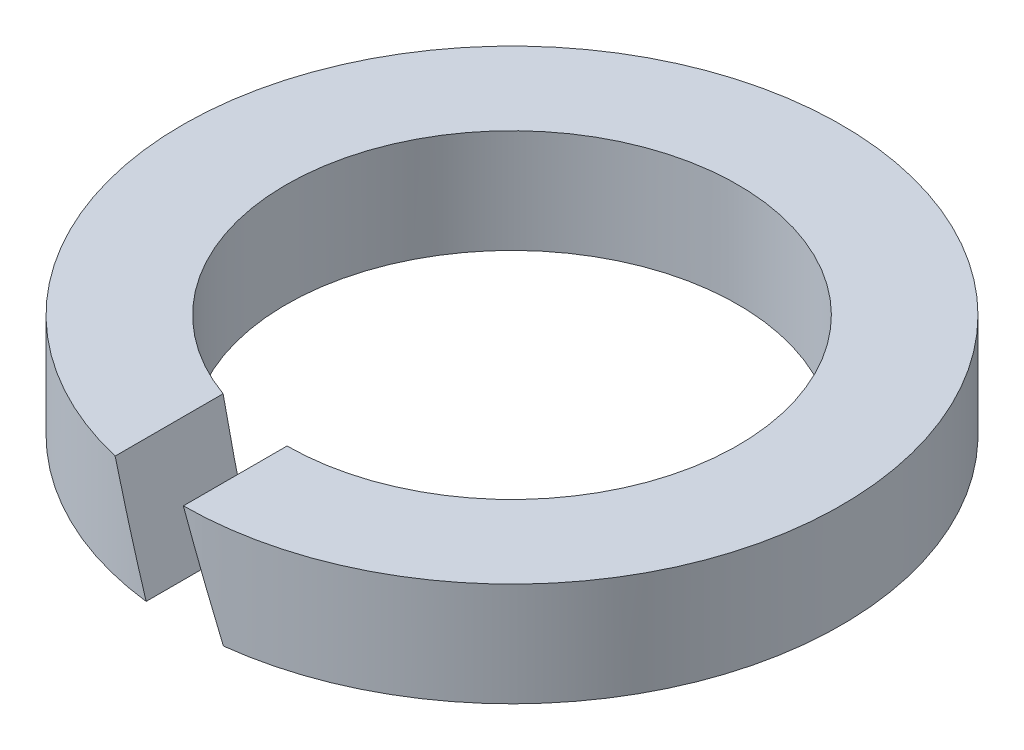
ISO-10303-21;
HEADER;
FILE_DESCRIPTION(('STEP AP214'),'2;1');
FILE_NAME('part.step','',(''),(''),'','','');
FILE_SCHEMA(('AUTOMOTIVE_DESIGN { 1 0 10303 214 1 1 1 1 }'));
ENDSEC;
DATA;
#1=APPLICATION_CONTEXT('core data for automotive mechanical design processes');
#2=APPLICATION_PROTOCOL_DEFINITION('international standard','automotive_design',2000,#1);
#3=PRODUCT_CONTEXT('',#1,'mechanical');
#4=PRODUCT('Part','Part','',(#3));
#5=PRODUCT_RELATED_PRODUCT_CATEGORY('part','',(#4));
#6=PRODUCT_DEFINITION_FORMATION('','',#4);
#7=PRODUCT_DEFINITION_CONTEXT('part definition',#1,'design');
#8=PRODUCT_DEFINITION('design','',#6,#7);
#9=PRODUCT_DEFINITION_SHAPE('','',#8);
#10=(LENGTH_UNIT() NAMED_UNIT(*) SI_UNIT(.MILLI.,.METRE.));
#11=(NAMED_UNIT(*) PLANE_ANGLE_UNIT() SI_UNIT($,.RADIAN.));
#12=(NAMED_UNIT(*) SI_UNIT($,.STERADIAN.) SOLID_ANGLE_UNIT());
#13=UNCERTAINTY_MEASURE_WITH_UNIT(LENGTH_MEASURE(1.E-05),#10,'distance_accuracy_value','');
#14=(GEOMETRIC_REPRESENTATION_CONTEXT(3) GLOBAL_UNCERTAINTY_ASSIGNED_CONTEXT((#13)) GLOBAL_UNIT_ASSIGNED_CONTEXT((#10,
#11,#12)) REPRESENTATION_CONTEXT('',''));
#15=CARTESIAN_POINT('',(0.,0.,0.));
#16=DIRECTION('',(0.,0.,1.));
#17=DIRECTION('',(1.,0.,0.));
#18=AXIS2_PLACEMENT_3D('',#15,#16,#17);
#19=CARTESIAN_POINT('',(0.,15.7596723055964,0.));
#20=DIRECTION('',(0.,1.,0.));
#21=DIRECTION('',(0.,0.,1.));
#22=AXIS2_PLACEMENT_3D('',#19,#20,#21);
#23=CYLINDRICAL_SURFACE('',#22,3.05);
#24=CARTESIAN_POINT('',(0.,0.,0.));
#25=DIRECTION('',(0.,1.,0.));
#26=DIRECTION('',(0.,0.,1.));
#27=AXIS2_PLACEMENT_3D('',#24,#25,#26);
#28=CIRCLE('',#27,3.05);
#29=CARTESIAN_POINT('',(0.521447108513197,0.,3.00509449319372));
#30=VERTEX_POINT('',#29);
#31=CARTESIAN_POINT('',(-0.521447108513196,0.,3.00509449319372));
#32=VERTEX_POINT('',#31);
#33=EDGE_CURVE('E91',#30,#32,#28,.T.);
#34=ORIENTED_EDGE('',*,*,#33,.F.);
#35=CARTESIAN_POINT('',(0.,1.43266415607992,0.));
#36=DIRECTION('',(-0.939692620785909,-0.342020143325666,0.));
#37=DIRECTION('',(-0.342020143325666,0.939692620785909,0.));
#38=AXIS2_PLACEMENT_3D('',#35,#36,#37);
#39=ELLIPSE('',#38,8.91760342049747,3.05);
#40=CARTESIAN_POINT('',(0.0118887805405175,1.4,3.04997682891153));
#41=VERTEX_POINT('',#40);
#42=EDGE_CURVE('E56',#41,#30,#39,.F.);
#43=ORIENTED_EDGE('',*,*,#42,.F.);
#44=CARTESIAN_POINT('',(0.,1.4,0.));
#45=DIRECTION('',(0.,1.,0.));
#46=DIRECTION('',(0.,0.,1.));
#47=AXIS2_PLACEMENT_3D('',#44,#45,#46);
#48=CIRCLE('',#47,3.05);
#49=CARTESIAN_POINT('',(-1.03100543648588,1.4,2.87045776661782));
#50=VERTEX_POINT('',#49);
#51=EDGE_CURVE('E11',#41,#50,#48,.T.);
#52=ORIENTED_EDGE('',*,*,#51,.T.);
#53=CARTESIAN_POINT('',(0.,-1.43266415607992,0.));
#54=DIRECTION('',(0.939692620785909,0.342020143325666,0.));
#55=DIRECTION('',(-0.342020143325666,0.939692620785909,0.));
#56=AXIS2_PLACEMENT_3D('',#53,#54,#55);
#57=ELLIPSE('',#56,8.91760342049748,3.05);
#58=EDGE_CURVE('E88',#32,#50,#57,.F.);
#59=ORIENTED_EDGE('',*,*,#58,.F.);
#60=EDGE_LOOP('',(#34,#43,#52,#59));
#61=FACE_BOUND('',#60,.T.);
#62=ADVANCED_FACE('F34',(#61),#23,.F.);
#63=CARTESIAN_POINT('',(-3.05,1.4,0.));
#64=DIRECTION('',(0.,1.,0.));
#65=DIRECTION('',(0.,0.,1.));
#66=AXIS2_PLACEMENT_3D('',#63,#64,#65);
#67=PLANE('',#66);
#68=ORIENTED_EDGE('',*,*,#51,.F.);
#69=DIRECTION('',(0.,0.,-1.));
#70=VECTOR('',#69,1.);
#71=CARTESIAN_POINT('',(0.0118887805405175,1.4,4.451));
#72=LINE('',#71,#70);
#73=CARTESIAN_POINT('',(0.0118887805405175,1.4,4.44998411872416));
#74=VERTEX_POINT('',#73);
#75=EDGE_CURVE('E93',#74,#41,#72,.T.);
#76=ORIENTED_EDGE('',*,*,#75,.F.);
#77=CARTESIAN_POINT('',(0.,1.4,0.));
#78=DIRECTION('',(0.,1.,0.));
#79=DIRECTION('',(0.,0.,1.));
#80=AXIS2_PLACEMENT_3D('',#77,#78,#79);
#81=CIRCLE('',#80,4.45);
#82=CARTESIAN_POINT('',(-1.03100543648588,1.4,4.32891762337153));
#83=VERTEX_POINT('',#82);
#84=EDGE_CURVE('E41',#74,#83,#81,.T.);
#85=ORIENTED_EDGE('',*,*,#84,.T.);
#86=DIRECTION('',(0.,0.,-1.));
#87=VECTOR('',#86,1.);
#88=CARTESIAN_POINT('',(-1.03100543648588,1.4,4.451));
#89=LINE('',#88,#87);
#90=EDGE_CURVE('E97',#83,#50,#89,.T.);
#91=ORIENTED_EDGE('',*,*,#90,.T.);
#92=EDGE_LOOP('',(#68,#76,#85,#91));
#93=FACE_BOUND('',#92,.T.);
#94=ADVANCED_FACE('F108',(#93),#67,.T.);
#95=CARTESIAN_POINT('',(0.,15.7596723055964,0.));
#96=DIRECTION('',(0.,1.,0.));
#97=DIRECTION('',(0.,0.,1.));
#98=AXIS2_PLACEMENT_3D('',#95,#96,#97);
#99=CYLINDRICAL_SURFACE('',#98,4.45);
#100=ORIENTED_EDGE('',*,*,#84,.F.);
#101=CARTESIAN_POINT('',(0.,1.43266415607992,0.));
#102=DIRECTION('',(-0.939692620785909,-0.342020143325666,0.));
#103=DIRECTION('',(-0.342020143325666,0.939692620785909,0.));
#104=AXIS2_PLACEMENT_3D('',#101,#102,#103);
#105=ELLIPSE('',#104,13.0109295807258,4.45);
#106=CARTESIAN_POINT('',(0.521447108513196,0.,4.41934304088551));
#107=VERTEX_POINT('',#106);
#108=EDGE_CURVE('E74',#107,#74,#105,.T.);
#109=ORIENTED_EDGE('',*,*,#108,.F.);
#110=CARTESIAN_POINT('',(0.,0.,0.));
#111=DIRECTION('',(0.,1.,0.));
#112=DIRECTION('',(0.,0.,1.));
#113=AXIS2_PLACEMENT_3D('',#110,#111,#112);
#114=CIRCLE('',#113,4.45);
#115=CARTESIAN_POINT('',(-0.521447108513196,0.,4.41934304088551));
#116=VERTEX_POINT('',#115);
#117=EDGE_CURVE('E86',#107,#116,#114,.T.);
#118=ORIENTED_EDGE('',*,*,#117,.T.);
#119=CARTESIAN_POINT('',(0.,-1.43266415607992,0.));
#120=DIRECTION('',(0.939692620785909,0.342020143325666,0.));
#121=DIRECTION('',(-0.342020143325666,0.939692620785909,0.));
#122=AXIS2_PLACEMENT_3D('',#119,#120,#121);
#123=ELLIPSE('',#122,13.0109295807258,4.45);
#124=EDGE_CURVE('E48',#83,#116,#123,.T.);
#125=ORIENTED_EDGE('',*,*,#124,.F.);
#126=EDGE_LOOP('',(#100,#109,#118,#125));
#127=FACE_BOUND('',#126,.T.);
#128=ADVANCED_FACE('F85',(#127),#99,.T.);
#129=CARTESIAN_POINT('',(-3.05,0.,0.));
#130=DIRECTION('',(0.,-1.,0.));
#131=DIRECTION('',(0.,0.,-1.));
#132=AXIS2_PLACEMENT_3D('',#129,#130,#131);
#133=PLANE('',#132);
#134=ORIENTED_EDGE('',*,*,#117,.F.);
#135=DIRECTION('',(0.,0.,-1.));
#136=VECTOR('',#135,1.);
#137=CARTESIAN_POINT('',(0.521447108513197,0.,4.451));
#138=LINE('',#137,#136);
#139=EDGE_CURVE('E71',#107,#30,#138,.T.);
#140=ORIENTED_EDGE('',*,*,#139,.T.);
#141=ORIENTED_EDGE('',*,*,#33,.T.);
#142=DIRECTION('',(0.,0.,-1.));
#143=VECTOR('',#142,1.);
#144=CARTESIAN_POINT('',(-0.521447108513197,0.,4.451));
#145=LINE('',#144,#143);
#146=EDGE_CURVE('E80',#116,#32,#145,.T.);
#147=ORIENTED_EDGE('',*,*,#146,.F.);
#148=EDGE_LOOP('',(#134,#140,#141,#147));
#149=FACE_BOUND('',#148,.T.);
#150=ADVANCED_FACE('F90',(#149),#133,.T.);
#151=CARTESIAN_POINT('',(-1.03100543648588,1.4,4.451));
#152=DIRECTION('',(0.939692620785909,0.342020143325666,0.));
#153=DIRECTION('',(-0.342020143325666,0.939692620785909,0.));
#154=AXIS2_PLACEMENT_3D('',#151,#152,#153);
#155=PLANE('',#154);
#156=ORIENTED_EDGE('',*,*,#58,.T.);
#157=ORIENTED_EDGE('',*,*,#90,.F.);
#158=ORIENTED_EDGE('',*,*,#124,.T.);
#159=ORIENTED_EDGE('',*,*,#146,.T.);
#160=EDGE_LOOP('',(#156,#157,#158,#159));
#161=FACE_BOUND('',#160,.T.);
#162=ADVANCED_FACE('F104',(#161),#155,.T.);
#163=CARTESIAN_POINT('',(0.0118887805405175,1.4,4.451));
#164=DIRECTION('',(-0.939692620785909,-0.342020143325666,0.));
#165=DIRECTION('',(0.342020143325666,-0.939692620785909,0.));
#166=AXIS2_PLACEMENT_3D('',#163,#164,#165);
#167=PLANE('',#166);
#168=ORIENTED_EDGE('',*,*,#42,.T.);
#169=ORIENTED_EDGE('',*,*,#139,.F.);
#170=ORIENTED_EDGE('',*,*,#108,.T.);
#171=ORIENTED_EDGE('',*,*,#75,.T.);
#172=EDGE_LOOP('',(#168,#169,#170,#171));
#173=FACE_BOUND('',#172,.T.);
#174=ADVANCED_FACE('F73',(#173),#167,.T.);
#175=CLOSED_SHELL('',(#62,#94,#128,#150,#162,#174));
#176=MANIFOLD_SOLID_BREP('B2',#175);
#177=ADVANCED_BREP_SHAPE_REPRESENTATION('',(#18,#176),#14);
#178=SHAPE_DEFINITION_REPRESENTATION(#9,#177);
ENDSEC;
END-ISO-10303-21;
